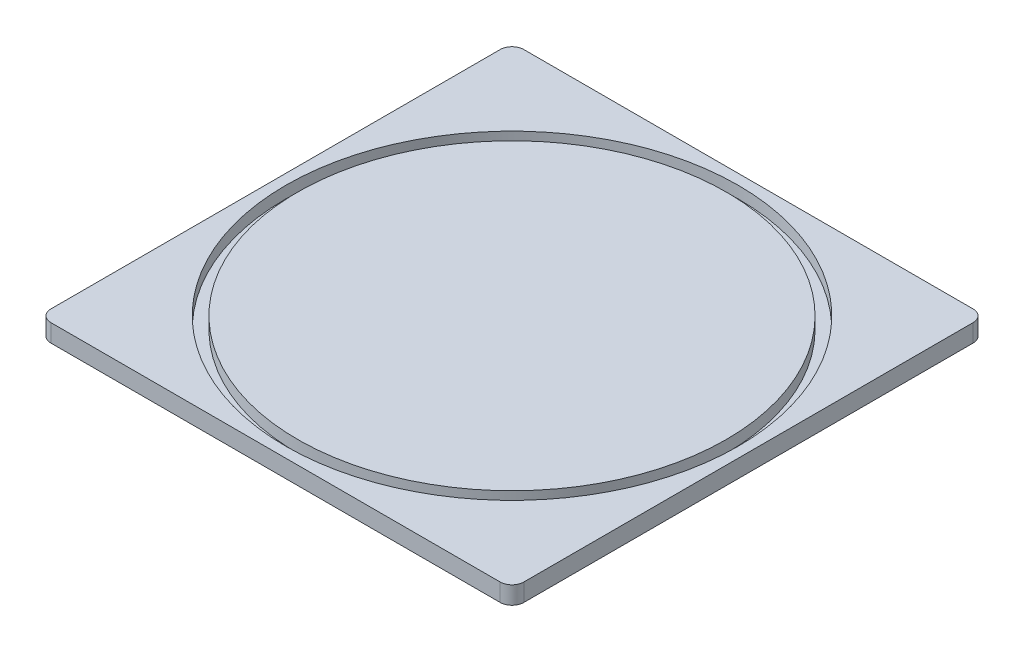
ISO-10303-21;
HEADER;
FILE_DESCRIPTION(('STEP AP214'),'2;1');
FILE_NAME('part.step','',(''),(''),'','','');
FILE_SCHEMA(('AUTOMOTIVE_DESIGN { 1 0 10303 214 1 1 1 1 }'));
ENDSEC;
DATA;
#1=APPLICATION_CONTEXT('core data for automotive mechanical design processes');
#2=APPLICATION_PROTOCOL_DEFINITION('international standard','automotive_design',2000,#1);
#3=PRODUCT_CONTEXT('',#1,'mechanical');
#4=PRODUCT('Part','Part','',(#3));
#5=PRODUCT_RELATED_PRODUCT_CATEGORY('part','',(#4));
#6=PRODUCT_DEFINITION_FORMATION('','',#4);
#7=PRODUCT_DEFINITION_CONTEXT('part definition',#1,'design');
#8=PRODUCT_DEFINITION('design','',#6,#7);
#9=PRODUCT_DEFINITION_SHAPE('','',#8);
#10=(LENGTH_UNIT() NAMED_UNIT(*) SI_UNIT(.MILLI.,.METRE.));
#11=(NAMED_UNIT(*) PLANE_ANGLE_UNIT() SI_UNIT($,.RADIAN.));
#12=(NAMED_UNIT(*) SI_UNIT($,.STERADIAN.) SOLID_ANGLE_UNIT());
#13=UNCERTAINTY_MEASURE_WITH_UNIT(LENGTH_MEASURE(1.E-05),#10,'distance_accuracy_value','');
#14=(GEOMETRIC_REPRESENTATION_CONTEXT(3) GLOBAL_UNCERTAINTY_ASSIGNED_CONTEXT((#13)) GLOBAL_UNIT_ASSIGNED_CONTEXT((#10,
#11,#12)) REPRESENTATION_CONTEXT('',''));
#15=CARTESIAN_POINT('',(0.,0.,0.));
#16=DIRECTION('',(0.,0.,1.));
#17=DIRECTION('',(1.,0.,0.));
#18=AXIS2_PLACEMENT_3D('',#15,#16,#17);
#19=CARTESIAN_POINT('',(80.,3.,-40.));
#20=DIRECTION('',(0.,0.,1.));
#21=DIRECTION('',(1.,0.,0.));
#22=AXIS2_PLACEMENT_3D('',#19,#20,#21);
#23=PLANE('',#22);
#24=DIRECTION('',(-1.,0.,0.));
#25=VECTOR('',#24,1.);
#26=CARTESIAN_POINT('',(80.,0.,-40.));
#27=LINE('',#26,#25);
#28=CARTESIAN_POINT('',(78.,0.,-40.));
#29=VERTEX_POINT('',#28);
#30=CARTESIAN_POINT('',(2.,0.,-40.));
#31=VERTEX_POINT('',#30);
#32=EDGE_CURVE('E133',#29,#31,#27,.T.);
#33=ORIENTED_EDGE('',*,*,#32,.T.);
#34=DIRECTION('',(0.,-1.,0.));
#35=VECTOR('',#34,1.);
#36=CARTESIAN_POINT('',(2.,3.,-40.));
#37=LINE('',#36,#35);
#38=CARTESIAN_POINT('',(2.,3.,-40.));
#39=VERTEX_POINT('',#38);
#40=EDGE_CURVE('E111',#31,#39,#37,.F.);
#41=ORIENTED_EDGE('',*,*,#40,.T.);
#42=DIRECTION('',(-1.,0.,0.));
#43=VECTOR('',#42,1.);
#44=CARTESIAN_POINT('',(80.,3.,-40.));
#45=LINE('',#44,#43);
#46=CARTESIAN_POINT('',(78.,3.,-40.));
#47=VERTEX_POINT('',#46);
#48=EDGE_CURVE('E143',#47,#39,#45,.T.);
#49=ORIENTED_EDGE('',*,*,#48,.F.);
#50=DIRECTION('',(0.,-1.,0.));
#51=VECTOR('',#50,1.);
#52=CARTESIAN_POINT('',(78.,3.,-40.));
#53=LINE('',#52,#51);
#54=EDGE_CURVE('E116',#47,#29,#53,.T.);
#55=ORIENTED_EDGE('',*,*,#54,.T.);
#56=EDGE_LOOP('',(#33,#41,#49,#55));
#57=FACE_BOUND('',#56,.T.);
#58=ADVANCED_FACE('F41',(#57),#23,.F.);
#59=CARTESIAN_POINT('',(0.,3.,-40.));
#60=DIRECTION('',(1.,0.,0.));
#61=DIRECTION('',(0.,0.,-1.));
#62=AXIS2_PLACEMENT_3D('',#59,#60,#61);
#63=PLANE('',#62);
#64=DIRECTION('',(0.,0.,1.));
#65=VECTOR('',#64,1.);
#66=CARTESIAN_POINT('',(0.,3.,-40.));
#67=LINE('',#66,#65);
#68=CARTESIAN_POINT('',(0.,3.,-38.));
#69=VERTEX_POINT('',#68);
#70=CARTESIAN_POINT('',(0.,3.,38.));
#71=VERTEX_POINT('',#70);
#72=EDGE_CURVE('E126',#69,#71,#67,.T.);
#73=ORIENTED_EDGE('',*,*,#72,.F.);
#74=DIRECTION('',(0.,-1.,0.));
#75=VECTOR('',#74,1.);
#76=CARTESIAN_POINT('',(0.,3.,-38.));
#77=LINE('',#76,#75);
#78=CARTESIAN_POINT('',(0.,0.,-38.));
#79=VERTEX_POINT('',#78);
#80=EDGE_CURVE('E110',#69,#79,#77,.T.);
#81=ORIENTED_EDGE('',*,*,#80,.T.);
#82=DIRECTION('',(0.,0.,1.));
#83=VECTOR('',#82,1.);
#84=CARTESIAN_POINT('',(0.,0.,-40.));
#85=LINE('',#84,#83);
#86=CARTESIAN_POINT('',(0.,0.,38.));
#87=VERTEX_POINT('',#86);
#88=EDGE_CURVE('E123',#79,#87,#85,.T.);
#89=ORIENTED_EDGE('',*,*,#88,.T.);
#90=DIRECTION('',(0.,-1.,0.));
#91=VECTOR('',#90,1.);
#92=CARTESIAN_POINT('',(0.,3.,38.));
#93=LINE('',#92,#91);
#94=EDGE_CURVE('E128',#87,#71,#93,.F.);
#95=ORIENTED_EDGE('',*,*,#94,.T.);
#96=EDGE_LOOP('',(#73,#81,#89,#95));
#97=FACE_BOUND('',#96,.T.);
#98=ADVANCED_FACE('F122',(#97),#63,.F.);
#99=CARTESIAN_POINT('',(0.,3.,40.));
#100=DIRECTION('',(0.,0.,-1.));
#101=DIRECTION('',(-1.,0.,0.));
#102=AXIS2_PLACEMENT_3D('',#99,#100,#101);
#103=PLANE('',#102);
#104=DIRECTION('',(1.,0.,0.));
#105=VECTOR('',#104,1.);
#106=CARTESIAN_POINT('',(0.,3.,40.));
#107=LINE('',#106,#105);
#108=CARTESIAN_POINT('',(2.00000000000001,3.,40.));
#109=VERTEX_POINT('',#108);
#110=CARTESIAN_POINT('',(78.,3.,40.));
#111=VERTEX_POINT('',#110);
#112=EDGE_CURVE('E177',#109,#111,#107,.T.);
#113=ORIENTED_EDGE('',*,*,#112,.F.);
#114=DIRECTION('',(0.,-1.,0.));
#115=VECTOR('',#114,1.);
#116=CARTESIAN_POINT('',(2.00000000000001,3.,40.));
#117=LINE('',#116,#115);
#118=CARTESIAN_POINT('',(2.00000000000001,0.,40.));
#119=VERTEX_POINT('',#118);
#120=EDGE_CURVE('E162',#109,#119,#117,.T.);
#121=ORIENTED_EDGE('',*,*,#120,.T.);
#122=DIRECTION('',(1.,0.,0.));
#123=VECTOR('',#122,1.);
#124=CARTESIAN_POINT('',(0.,0.,40.));
#125=LINE('',#124,#123);
#126=CARTESIAN_POINT('',(78.,0.,40.));
#127=VERTEX_POINT('',#126);
#128=EDGE_CURVE('E132',#119,#127,#125,.T.);
#129=ORIENTED_EDGE('',*,*,#128,.T.);
#130=DIRECTION('',(0.,-1.,0.));
#131=VECTOR('',#130,1.);
#132=CARTESIAN_POINT('',(78.,3.,40.));
#133=LINE('',#132,#131);
#134=EDGE_CURVE('E160',#127,#111,#133,.F.);
#135=ORIENTED_EDGE('',*,*,#134,.T.);
#136=EDGE_LOOP('',(#113,#121,#129,#135));
#137=FACE_BOUND('',#136,.T.);
#138=ADVANCED_FACE('F194',(#137),#103,.F.);
#139=CARTESIAN_POINT('',(80.,3.,40.));
#140=DIRECTION('',(-1.,0.,0.));
#141=DIRECTION('',(0.,0.,1.));
#142=AXIS2_PLACEMENT_3D('',#139,#140,#141);
#143=PLANE('',#142);
#144=DIRECTION('',(0.,0.,-1.));
#145=VECTOR('',#144,1.);
#146=CARTESIAN_POINT('',(80.,0.,40.));
#147=LINE('',#146,#145);
#148=CARTESIAN_POINT('',(80.,0.,38.));
#149=VERTEX_POINT('',#148);
#150=CARTESIAN_POINT('',(80.,0.,-38.));
#151=VERTEX_POINT('',#150);
#152=EDGE_CURVE('E136',#149,#151,#147,.T.);
#153=ORIENTED_EDGE('',*,*,#152,.T.);
#154=DIRECTION('',(0.,-1.,0.));
#155=VECTOR('',#154,1.);
#156=CARTESIAN_POINT('',(80.,3.,-38.));
#157=LINE('',#156,#155);
#158=CARTESIAN_POINT('',(80.,3.,-38.));
#159=VERTEX_POINT('',#158);
#160=EDGE_CURVE('E12',#151,#159,#157,.F.);
#161=ORIENTED_EDGE('',*,*,#160,.T.);
#162=DIRECTION('',(0.,0.,-1.));
#163=VECTOR('',#162,1.);
#164=CARTESIAN_POINT('',(80.,3.,40.));
#165=LINE('',#164,#163);
#166=CARTESIAN_POINT('',(80.,3.,38.));
#167=VERTEX_POINT('',#166);
#168=EDGE_CURVE('E144',#167,#159,#165,.T.);
#169=ORIENTED_EDGE('',*,*,#168,.F.);
#170=DIRECTION('',(0.,-1.,0.));
#171=VECTOR('',#170,1.);
#172=CARTESIAN_POINT('',(80.,3.,38.));
#173=LINE('',#172,#171);
#174=EDGE_CURVE('E49',#167,#149,#173,.T.);
#175=ORIENTED_EDGE('',*,*,#174,.T.);
#176=EDGE_LOOP('',(#153,#161,#169,#175));
#177=FACE_BOUND('',#176,.T.);
#178=ADVANCED_FACE('F167',(#177),#143,.F.);
#179=CARTESIAN_POINT('',(0.,3.,0.));
#180=DIRECTION('',(0.,1.,0.));
#181=DIRECTION('',(0.,0.,1.));
#182=AXIS2_PLACEMENT_3D('',#179,#180,#181);
#183=PLANE('',#182);
#184=CARTESIAN_POINT('',(40.,3.,0.));
#185=DIRECTION('',(0.,1.,0.));
#186=DIRECTION('',(0.,0.,1.));
#187=AXIS2_PLACEMENT_3D('',#184,#185,#186);
#188=CIRCLE('',#187,38.25);
#189=CARTESIAN_POINT('',(40.,3.,38.25));
#190=VERTEX_POINT('',#189);
#191=EDGE_CURVE('E180',#190,#190,#188,.T.);
#192=ORIENTED_EDGE('',*,*,#191,.F.);
#193=EDGE_LOOP('',(#192));
#194=FACE_BOUND('',#193,.T.);
#195=ORIENTED_EDGE('',*,*,#48,.T.);
#196=CARTESIAN_POINT('',(2.,3.,-38.));
#197=DIRECTION('',(0.,1.,0.));
#198=DIRECTION('',(0.,0.,1.));
#199=AXIS2_PLACEMENT_3D('',#196,#197,#198);
#200=CIRCLE('',#199,2.);
#201=EDGE_CURVE('E158',#39,#69,#200,.T.);
#202=ORIENTED_EDGE('',*,*,#201,.T.);
#203=ORIENTED_EDGE('',*,*,#72,.T.);
#204=CARTESIAN_POINT('',(2.00000000000001,3.,38.));
#205=DIRECTION('',(0.,1.,0.));
#206=DIRECTION('',(0.,0.,1.));
#207=AXIS2_PLACEMENT_3D('',#204,#205,#206);
#208=CIRCLE('',#207,2.);
#209=EDGE_CURVE('E156',#71,#109,#208,.T.);
#210=ORIENTED_EDGE('',*,*,#209,.T.);
#211=ORIENTED_EDGE('',*,*,#112,.T.);
#212=CARTESIAN_POINT('',(78.,3.,38.));
#213=DIRECTION('',(0.,1.,0.));
#214=DIRECTION('',(0.,0.,1.));
#215=AXIS2_PLACEMENT_3D('',#212,#213,#214);
#216=CIRCLE('',#215,2.);
#217=EDGE_CURVE('E61',#111,#167,#216,.T.);
#218=ORIENTED_EDGE('',*,*,#217,.T.);
#219=ORIENTED_EDGE('',*,*,#168,.T.);
#220=CARTESIAN_POINT('',(78.,3.,-38.));
#221=DIRECTION('',(0.,1.,0.));
#222=DIRECTION('',(0.,0.,1.));
#223=AXIS2_PLACEMENT_3D('',#220,#221,#222);
#224=CIRCLE('',#223,2.);
#225=EDGE_CURVE('E154',#159,#47,#224,.T.);
#226=ORIENTED_EDGE('',*,*,#225,.T.);
#227=EDGE_LOOP('',(#195,#202,#203,#210,#211,#218,#219,#226));
#228=FACE_BOUND('',#227,.T.);
#229=ADVANCED_FACE('F183',(#194,#228),#183,.T.);
#230=CARTESIAN_POINT('',(0.,0.,0.));
#231=DIRECTION('',(0.,1.,0.));
#232=DIRECTION('',(0.,0.,1.));
#233=AXIS2_PLACEMENT_3D('',#230,#231,#232);
#234=PLANE('',#233);
#235=ORIENTED_EDGE('',*,*,#88,.F.);
#236=CARTESIAN_POINT('',(2.,0.,-38.));
#237=DIRECTION('',(0.,1.,0.));
#238=DIRECTION('',(0.,0.,1.));
#239=AXIS2_PLACEMENT_3D('',#236,#237,#238);
#240=CIRCLE('',#239,2.);
#241=EDGE_CURVE('E106',#79,#31,#240,.F.);
#242=ORIENTED_EDGE('',*,*,#241,.T.);
#243=ORIENTED_EDGE('',*,*,#32,.F.);
#244=CARTESIAN_POINT('',(78.,0.,-38.));
#245=DIRECTION('',(0.,1.,0.));
#246=DIRECTION('',(0.,0.,1.));
#247=AXIS2_PLACEMENT_3D('',#244,#245,#246);
#248=CIRCLE('',#247,2.);
#249=EDGE_CURVE('E147',#29,#151,#248,.F.);
#250=ORIENTED_EDGE('',*,*,#249,.T.);
#251=ORIENTED_EDGE('',*,*,#152,.F.);
#252=CARTESIAN_POINT('',(78.,0.,38.));
#253=DIRECTION('',(0.,1.,0.));
#254=DIRECTION('',(0.,0.,1.));
#255=AXIS2_PLACEMENT_3D('',#252,#253,#254);
#256=CIRCLE('',#255,2.);
#257=EDGE_CURVE('E127',#149,#127,#256,.F.);
#258=ORIENTED_EDGE('',*,*,#257,.T.);
#259=ORIENTED_EDGE('',*,*,#128,.F.);
#260=CARTESIAN_POINT('',(2.00000000000001,0.,38.));
#261=DIRECTION('',(0.,1.,0.));
#262=DIRECTION('',(0.,0.,1.));
#263=AXIS2_PLACEMENT_3D('',#260,#261,#262);
#264=CIRCLE('',#263,2.);
#265=EDGE_CURVE('E117',#119,#87,#264,.F.);
#266=ORIENTED_EDGE('',*,*,#265,.T.);
#267=EDGE_LOOP('',(#235,#242,#243,#250,#251,#258,#259,#266));
#268=FACE_BOUND('',#267,.T.);
#269=ADVANCED_FACE('F130',(#268),#234,.F.);
#270=CARTESIAN_POINT('',(40.,1.,0.));
#271=DIRECTION('',(0.,1.,0.));
#272=DIRECTION('',(0.,0.,1.));
#273=AXIS2_PLACEMENT_3D('',#270,#271,#272);
#274=CYLINDRICAL_SURFACE('',#273,38.25);
#275=CARTESIAN_POINT('',(40.,1.,0.));
#276=DIRECTION('',(0.,1.,0.));
#277=DIRECTION('',(0.,0.,1.));
#278=AXIS2_PLACEMENT_3D('',#275,#276,#277);
#279=CIRCLE('',#278,38.25);
#280=CARTESIAN_POINT('',(40.,1.,38.25));
#281=VERTEX_POINT('',#280);
#282=EDGE_CURVE('E138',#281,#281,#279,.T.);
#283=ORIENTED_EDGE('',*,*,#282,.F.);
#284=EDGE_LOOP('',(#283));
#285=FACE_BOUND('',#284,.T.);
#286=ORIENTED_EDGE('',*,*,#191,.T.);
#287=EDGE_LOOP('',(#286));
#288=FACE_BOUND('',#287,.T.);
#289=ADVANCED_FACE('F192',(#285,#288),#274,.F.);
#290=CARTESIAN_POINT('',(40.,1.,0.));
#291=DIRECTION('',(0.,1.,0.));
#292=DIRECTION('',(0.,0.,1.));
#293=AXIS2_PLACEMENT_3D('',#290,#291,#292);
#294=PLANE('',#293);
#295=CARTESIAN_POINT('',(40.,1.,0.));
#296=DIRECTION('',(0.,1.,0.));
#297=DIRECTION('',(1.,0.,0.));
#298=AXIS2_PLACEMENT_3D('',#295,#296,#297);
#299=CIRCLE('',#298,36.25);
#300=CARTESIAN_POINT('',(76.25,1.,0.));
#301=VERTEX_POINT('',#300);
#302=EDGE_CURVE('E305',#301,#301,#299,.T.);
#303=ORIENTED_EDGE('',*,*,#302,.F.);
#304=EDGE_LOOP('',(#303));
#305=FACE_BOUND('',#304,.T.);
#306=ORIENTED_EDGE('',*,*,#282,.T.);
#307=EDGE_LOOP('',(#306));
#308=FACE_BOUND('',#307,.T.);
#309=ADVANCED_FACE('F278',(#305,#308),#294,.T.);
#310=CARTESIAN_POINT('',(40.,1.,0.));
#311=DIRECTION('',(0.,1.,0.));
#312=DIRECTION('',(0.,0.,1.));
#313=AXIS2_PLACEMENT_3D('',#310,#311,#312);
#314=CYLINDRICAL_SURFACE('',#313,36.25);
#315=ORIENTED_EDGE('',*,*,#302,.T.);
#316=EDGE_LOOP('',(#315));
#317=FACE_BOUND('',#316,.T.);
#318=CARTESIAN_POINT('',(40.,3.,0.));
#319=DIRECTION('',(0.,1.,0.));
#320=DIRECTION('',(1.,0.,0.));
#321=AXIS2_PLACEMENT_3D('',#318,#319,#320);
#322=CIRCLE('',#321,36.25);
#323=CARTESIAN_POINT('',(76.25,3.,0.));
#324=VERTEX_POINT('',#323);
#325=EDGE_CURVE('E307',#324,#324,#322,.T.);
#326=ORIENTED_EDGE('',*,*,#325,.F.);
#327=EDGE_LOOP('',(#326));
#328=FACE_BOUND('',#327,.T.);
#329=ADVANCED_FACE('F199',(#317,#328),#314,.T.);
#330=ORIENTED_EDGE('',*,*,#325,.T.);
#331=EDGE_LOOP('',(#330));
#332=FACE_BOUND('',#331,.T.);
#333=ADVANCED_FACE('F187',(#332),#183,.T.);
#334=CARTESIAN_POINT('',(2.,3.,-38.));
#335=DIRECTION('',(0.,-1.,0.));
#336=DIRECTION('',(0.,0.,-1.));
#337=AXIS2_PLACEMENT_3D('',#334,#335,#336);
#338=CYLINDRICAL_SURFACE('',#337,2.);
#339=ORIENTED_EDGE('',*,*,#201,.F.);
#340=ORIENTED_EDGE('',*,*,#40,.F.);
#341=ORIENTED_EDGE('',*,*,#241,.F.);
#342=ORIENTED_EDGE('',*,*,#80,.F.);
#343=EDGE_LOOP('',(#339,#340,#341,#342));
#344=FACE_BOUND('',#343,.T.);
#345=ADVANCED_FACE('F109',(#344),#338,.T.);
#346=CARTESIAN_POINT('',(2.00000000000001,3.,38.));
#347=DIRECTION('',(0.,-1.,0.));
#348=DIRECTION('',(0.,0.,-1.));
#349=AXIS2_PLACEMENT_3D('',#346,#347,#348);
#350=CYLINDRICAL_SURFACE('',#349,2.);
#351=ORIENTED_EDGE('',*,*,#209,.F.);
#352=ORIENTED_EDGE('',*,*,#94,.F.);
#353=ORIENTED_EDGE('',*,*,#265,.F.);
#354=ORIENTED_EDGE('',*,*,#120,.F.);
#355=EDGE_LOOP('',(#351,#352,#353,#354));
#356=FACE_BOUND('',#355,.T.);
#357=ADVANCED_FACE('F211',(#356),#350,.T.);
#358=CARTESIAN_POINT('',(78.,3.,-38.));
#359=DIRECTION('',(0.,-1.,0.));
#360=DIRECTION('',(0.,0.,-1.));
#361=AXIS2_PLACEMENT_3D('',#358,#359,#360);
#362=CYLINDRICAL_SURFACE('',#361,2.);
#363=ORIENTED_EDGE('',*,*,#225,.F.);
#364=ORIENTED_EDGE('',*,*,#160,.F.);
#365=ORIENTED_EDGE('',*,*,#249,.F.);
#366=ORIENTED_EDGE('',*,*,#54,.F.);
#367=EDGE_LOOP('',(#363,#364,#365,#366));
#368=FACE_BOUND('',#367,.T.);
#369=ADVANCED_FACE('F172',(#368),#362,.T.);
#370=CARTESIAN_POINT('',(78.,3.,38.));
#371=DIRECTION('',(0.,-1.,0.));
#372=DIRECTION('',(0.,0.,-1.));
#373=AXIS2_PLACEMENT_3D('',#370,#371,#372);
#374=CYLINDRICAL_SURFACE('',#373,2.);
#375=ORIENTED_EDGE('',*,*,#217,.F.);
#376=ORIENTED_EDGE('',*,*,#134,.F.);
#377=ORIENTED_EDGE('',*,*,#257,.F.);
#378=ORIENTED_EDGE('',*,*,#174,.F.);
#379=EDGE_LOOP('',(#375,#376,#377,#378));
#380=FACE_BOUND('',#379,.T.);
#381=ADVANCED_FACE('F43',(#380),#374,.T.);
#382=CLOSED_SHELL('',(#58,#98,#138,#178,#229,#269,#289,#309,#329,#333,#345,#357,#369,#381));
#383=MANIFOLD_SOLID_BREP('B2',#382);
#384=ADVANCED_BREP_SHAPE_REPRESENTATION('',(#18,#383),#14);
#385=SHAPE_DEFINITION_REPRESENTATION(#9,#384);
ENDSEC;
END-ISO-10303-21;
